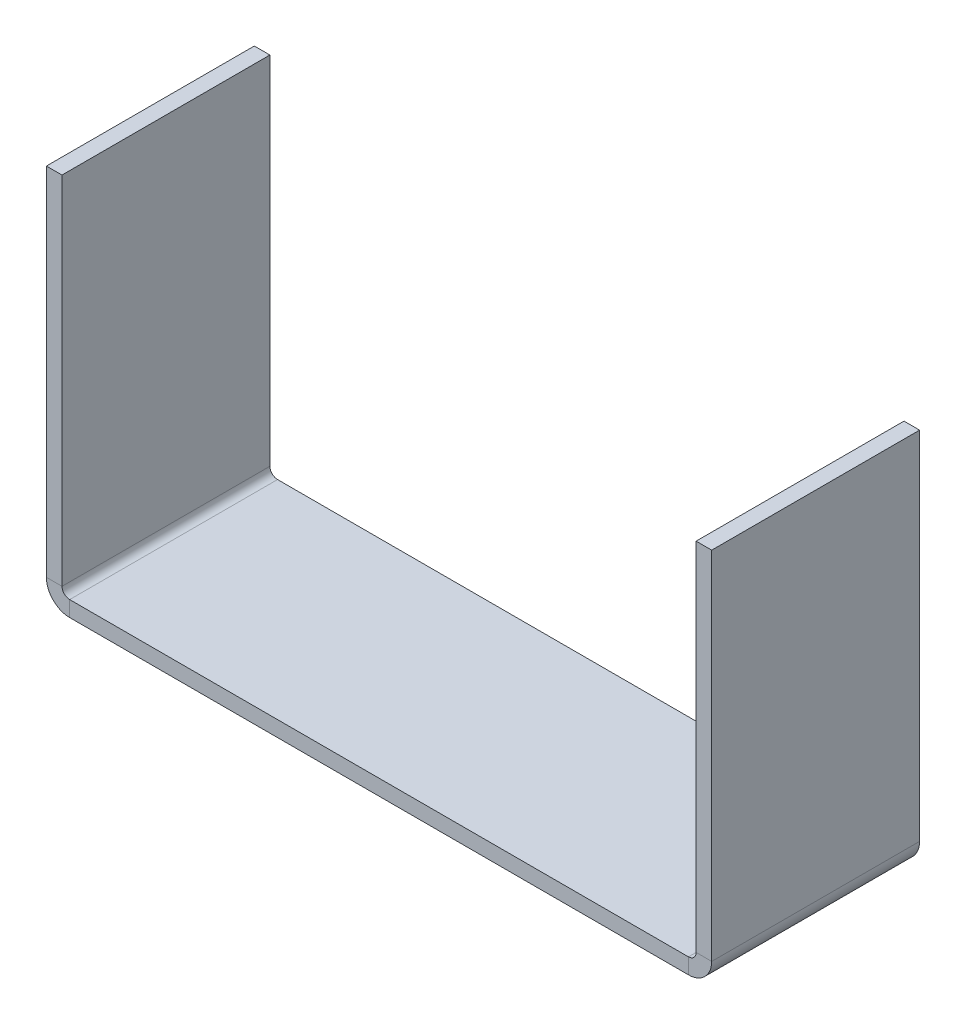
ISO-10303-21;
HEADER;
FILE_DESCRIPTION(('STEP AP214'),'2;1');
FILE_NAME('part.step','',(''),(''),'','','');
FILE_SCHEMA(('AUTOMOTIVE_DESIGN { 1 0 10303 214 1 1 1 1 }'));
ENDSEC;
DATA;
#1=APPLICATION_CONTEXT('core data for automotive mechanical design processes');
#2=APPLICATION_PROTOCOL_DEFINITION('international standard','automotive_design',2000,#1);
#3=PRODUCT_CONTEXT('',#1,'mechanical');
#4=PRODUCT('Part','Part','',(#3));
#5=PRODUCT_RELATED_PRODUCT_CATEGORY('part','',(#4));
#6=PRODUCT_DEFINITION_FORMATION('','',#4);
#7=PRODUCT_DEFINITION_CONTEXT('part definition',#1,'design');
#8=PRODUCT_DEFINITION('design','',#6,#7);
#9=PRODUCT_DEFINITION_SHAPE('','',#8);
#10=(LENGTH_UNIT() NAMED_UNIT(*) SI_UNIT(.MILLI.,.METRE.));
#11=(NAMED_UNIT(*) PLANE_ANGLE_UNIT() SI_UNIT($,.RADIAN.));
#12=(NAMED_UNIT(*) SI_UNIT($,.STERADIAN.) SOLID_ANGLE_UNIT());
#13=UNCERTAINTY_MEASURE_WITH_UNIT(LENGTH_MEASURE(1.E-05),#10,'distance_accuracy_value','');
#14=(GEOMETRIC_REPRESENTATION_CONTEXT(3) GLOBAL_UNCERTAINTY_ASSIGNED_CONTEXT((#13)) GLOBAL_UNIT_ASSIGNED_CONTEXT((#10,
#11,#12)) REPRESENTATION_CONTEXT('',''));
#15=CARTESIAN_POINT('',(0.,0.,0.));
#16=DIRECTION('',(0.,0.,1.));
#17=DIRECTION('',(1.,0.,0.));
#18=AXIS2_PLACEMENT_3D('',#15,#16,#17);
#19=CARTESIAN_POINT('',(0.,-1.5,0.));
#20=DIRECTION('',(0.,-1.,0.));
#21=DIRECTION('',(0.,0.,-1.));
#22=AXIS2_PLACEMENT_3D('',#19,#20,#21);
#23=PLANE('',#22);
#24=DIRECTION('',(-1.,0.,0.));
#25=VECTOR('',#24,1.);
#26=CARTESIAN_POINT('',(0.,-1.5,-20.));
#27=LINE('',#26,#25);
#28=CARTESIAN_POINT('',(61.7634,-1.49999999999999,-20.));
#29=VERTEX_POINT('',#28);
#30=CARTESIAN_POINT('',(2.2366,-1.5,-20.));
#31=VERTEX_POINT('',#30);
#32=EDGE_CURVE('E13',#29,#31,#27,.T.);
#33=ORIENTED_EDGE('',*,*,#32,.F.);
#34=DIRECTION('',(0.,0.,-1.));
#35=VECTOR('',#34,1.);
#36=CARTESIAN_POINT('',(61.7634,-1.49999999999999,-20.));
#37=LINE('',#36,#35);
#38=CARTESIAN_POINT('',(61.7634,-1.5,0.));
#39=VERTEX_POINT('',#38);
#40=EDGE_CURVE('E323',#29,#39,#37,.F.);
#41=ORIENTED_EDGE('',*,*,#40,.T.);
#42=DIRECTION('',(1.,0.,0.));
#43=VECTOR('',#42,1.);
#44=CARTESIAN_POINT('',(0.,-1.5,0.));
#45=LINE('',#44,#43);
#46=CARTESIAN_POINT('',(2.2366,-1.5,0.));
#47=VERTEX_POINT('',#46);
#48=EDGE_CURVE('E84',#47,#39,#45,.T.);
#49=ORIENTED_EDGE('',*,*,#48,.F.);
#50=DIRECTION('',(0.,0.,1.));
#51=VECTOR('',#50,1.);
#52=CARTESIAN_POINT('',(2.2366,-1.5,0.));
#53=LINE('',#52,#51);
#54=EDGE_CURVE('E98',#47,#31,#53,.F.);
#55=ORIENTED_EDGE('',*,*,#54,.T.);
#56=EDGE_LOOP('',(#33,#41,#49,#55));
#57=FACE_BOUND('',#56,.T.);
#58=ADVANCED_FACE('F75',(#57),#23,.T.);
#59=CARTESIAN_POINT('',(0.,0.,0.));
#60=DIRECTION('',(0.,-1.,0.));
#61=DIRECTION('',(0.,0.,-1.));
#62=AXIS2_PLACEMENT_3D('',#59,#60,#61);
#63=PLANE('',#62);
#64=DIRECTION('',(0.,0.,-1.));
#65=VECTOR('',#64,1.);
#66=CARTESIAN_POINT('',(61.7634,0.,-20.));
#67=LINE('',#66,#65);
#68=CARTESIAN_POINT('',(61.7634,0.,-20.));
#69=VERTEX_POINT('',#68);
#70=CARTESIAN_POINT('',(61.7634,0.,0.));
#71=VERTEX_POINT('',#70);
#72=EDGE_CURVE('E195',#69,#71,#67,.F.);
#73=ORIENTED_EDGE('',*,*,#72,.F.);
#74=DIRECTION('',(-1.,0.,0.));
#75=VECTOR('',#74,1.);
#76=CARTESIAN_POINT('',(0.,0.,-20.));
#77=LINE('',#76,#75);
#78=CARTESIAN_POINT('',(2.2366,0.,-20.));
#79=VERTEX_POINT('',#78);
#80=EDGE_CURVE('E79',#69,#79,#77,.T.);
#81=ORIENTED_EDGE('',*,*,#80,.T.);
#82=DIRECTION('',(0.,0.,1.));
#83=VECTOR('',#82,1.);
#84=CARTESIAN_POINT('',(2.2366,0.,0.));
#85=LINE('',#84,#83);
#86=CARTESIAN_POINT('',(2.2366,0.,0.));
#87=VERTEX_POINT('',#86);
#88=EDGE_CURVE('E142',#87,#79,#85,.F.);
#89=ORIENTED_EDGE('',*,*,#88,.F.);
#90=DIRECTION('',(1.,0.,0.));
#91=VECTOR('',#90,1.);
#92=CARTESIAN_POINT('',(0.,0.,0.));
#93=LINE('',#92,#91);
#94=EDGE_CURVE('E183',#87,#71,#93,.T.);
#95=ORIENTED_EDGE('',*,*,#94,.T.);
#96=EDGE_LOOP('',(#73,#81,#89,#95));
#97=FACE_BOUND('',#96,.T.);
#98=ADVANCED_FACE('F192',(#97),#63,.F.);
#99=CARTESIAN_POINT('',(0.,-1.5,-20.));
#100=DIRECTION('',(0.,0.,-1.));
#101=DIRECTION('',(-1.,0.,0.));
#102=AXIS2_PLACEMENT_3D('',#99,#100,#101);
#103=PLANE('',#102);
#104=ORIENTED_EDGE('',*,*,#80,.F.);
#105=DIRECTION('',(0.,-1.,0.));
#106=VECTOR('',#105,1.);
#107=CARTESIAN_POINT('',(61.7634,0.,-20.));
#108=LINE('',#107,#106);
#109=EDGE_CURVE('E329',#69,#29,#108,.T.);
#110=ORIENTED_EDGE('',*,*,#109,.T.);
#111=ORIENTED_EDGE('',*,*,#32,.T.);
#112=DIRECTION('',(0.,-1.,0.));
#113=VECTOR('',#112,1.);
#114=CARTESIAN_POINT('',(2.2366,0.,-20.));
#115=LINE('',#114,#113);
#116=EDGE_CURVE('E180',#79,#31,#115,.T.);
#117=ORIENTED_EDGE('',*,*,#116,.F.);
#118=EDGE_LOOP('',(#104,#110,#111,#117));
#119=FACE_BOUND('',#118,.T.);
#120=ADVANCED_FACE('F198',(#119),#103,.T.);
#121=CARTESIAN_POINT('',(0.,-1.5,0.));
#122=DIRECTION('',(0.,0.,1.));
#123=DIRECTION('',(1.,0.,0.));
#124=AXIS2_PLACEMENT_3D('',#121,#122,#123);
#125=PLANE('',#124);
#126=DIRECTION('',(0.,-1.,0.));
#127=VECTOR('',#126,1.);
#128=CARTESIAN_POINT('',(61.7634,0.,0.));
#129=LINE('',#128,#127);
#130=EDGE_CURVE('E171',#71,#39,#129,.T.);
#131=ORIENTED_EDGE('',*,*,#130,.F.);
#132=ORIENTED_EDGE('',*,*,#94,.F.);
#133=DIRECTION('',(0.,-1.,0.));
#134=VECTOR('',#133,1.);
#135=CARTESIAN_POINT('',(2.2366,0.,0.));
#136=LINE('',#135,#134);
#137=EDGE_CURVE('E141',#87,#47,#136,.T.);
#138=ORIENTED_EDGE('',*,*,#137,.T.);
#139=ORIENTED_EDGE('',*,*,#48,.T.);
#140=EDGE_LOOP('',(#131,#132,#138,#139));
#141=FACE_BOUND('',#140,.T.);
#142=ADVANCED_FACE('F77',(#141),#125,.T.);
#143=CARTESIAN_POINT('',(2.2366,0.7366,-20.));
#144=DIRECTION('',(0.,0.,-1.));
#145=DIRECTION('',(-1.,0.,0.));
#146=AXIS2_PLACEMENT_3D('',#143,#144,#145);
#147=PLANE('',#146);
#148=DIRECTION('',(1.,0.,0.));
#149=VECTOR('',#148,1.);
#150=CARTESIAN_POINT('',(0.,0.736599999999992,-20.));
#151=LINE('',#150,#149);
#152=CARTESIAN_POINT('',(1.5,0.736599999999997,-20.));
#153=VERTEX_POINT('',#152);
#154=CARTESIAN_POINT('',(0.,0.736599999999992,-20.));
#155=VERTEX_POINT('',#154);
#156=EDGE_CURVE('E132',#153,#155,#151,.F.);
#157=ORIENTED_EDGE('',*,*,#156,.F.);
#158=CARTESIAN_POINT('',(2.2366,0.7366,-20.));
#159=DIRECTION('',(0.,0.,1.));
#160=DIRECTION('',(1.,0.,0.));
#161=AXIS2_PLACEMENT_3D('',#158,#159,#160);
#162=CIRCLE('',#161,0.7366);
#163=EDGE_CURVE('E126',#79,#153,#162,.F.);
#164=ORIENTED_EDGE('',*,*,#163,.F.);
#165=ORIENTED_EDGE('',*,*,#116,.T.);
#166=CARTESIAN_POINT('',(2.2366,0.7366,-20.));
#167=DIRECTION('',(0.,0.,1.));
#168=DIRECTION('',(1.,0.,0.));
#169=AXIS2_PLACEMENT_3D('',#166,#167,#168);
#170=CIRCLE('',#169,2.2366);
#171=EDGE_CURVE('E173',#31,#155,#170,.F.);
#172=ORIENTED_EDGE('',*,*,#171,.T.);
#173=EDGE_LOOP('',(#157,#164,#165,#172));
#174=FACE_BOUND('',#173,.T.);
#175=ADVANCED_FACE('F197',(#174),#147,.T.);
#176=CARTESIAN_POINT('',(2.2366,0.7366,0.));
#177=DIRECTION('',(0.,0.,-1.));
#178=DIRECTION('',(-1.,0.,0.));
#179=AXIS2_PLACEMENT_3D('',#176,#177,#178);
#180=PLANE('',#179);
#181=CARTESIAN_POINT('',(2.2366,0.7366,0.));
#182=DIRECTION('',(0.,0.,1.));
#183=DIRECTION('',(1.,0.,0.));
#184=AXIS2_PLACEMENT_3D('',#181,#182,#183);
#185=CIRCLE('',#184,0.7366);
#186=CARTESIAN_POINT('',(1.5,0.736599999999997,0.));
#187=VERTEX_POINT('',#186);
#188=EDGE_CURVE('E123',#187,#87,#185,.T.);
#189=ORIENTED_EDGE('',*,*,#188,.F.);
#190=DIRECTION('',(1.,0.,0.));
#191=VECTOR('',#190,1.);
#192=CARTESIAN_POINT('',(1.5,0.736599999999997,0.));
#193=LINE('',#192,#191);
#194=CARTESIAN_POINT('',(0.,0.736599999999992,0.));
#195=VERTEX_POINT('',#194);
#196=EDGE_CURVE('E131',#187,#195,#193,.F.);
#197=ORIENTED_EDGE('',*,*,#196,.T.);
#198=CARTESIAN_POINT('',(2.2366,0.7366,0.));
#199=DIRECTION('',(0.,0.,1.));
#200=DIRECTION('',(1.,0.,0.));
#201=AXIS2_PLACEMENT_3D('',#198,#199,#200);
#202=CIRCLE('',#201,2.2366);
#203=EDGE_CURVE('E174',#195,#47,#202,.T.);
#204=ORIENTED_EDGE('',*,*,#203,.T.);
#205=ORIENTED_EDGE('',*,*,#137,.F.);
#206=EDGE_LOOP('',(#189,#197,#204,#205));
#207=FACE_BOUND('',#206,.T.);
#208=ADVANCED_FACE('F137',(#207),#180,.F.);
#209=CARTESIAN_POINT('',(2.2366,0.7366,0.));
#210=DIRECTION('',(0.,0.,1.));
#211=DIRECTION('',(-1.,0.,0.));
#212=AXIS2_PLACEMENT_3D('',#209,#210,#211);
#213=CYLINDRICAL_SURFACE('',#212,2.2366);
#214=ORIENTED_EDGE('',*,*,#54,.F.);
#215=ORIENTED_EDGE('',*,*,#203,.F.);
#216=DIRECTION('',(0.,0.,1.));
#217=VECTOR('',#216,1.);
#218=CARTESIAN_POINT('',(0.,0.736599999999992,-20.));
#219=LINE('',#218,#217);
#220=EDGE_CURVE('E155',#195,#155,#219,.F.);
#221=ORIENTED_EDGE('',*,*,#220,.T.);
#222=ORIENTED_EDGE('',*,*,#171,.F.);
#223=EDGE_LOOP('',(#214,#215,#221,#222));
#224=FACE_BOUND('',#223,.T.);
#225=ADVANCED_FACE('F214',(#224),#213,.T.);
#226=CARTESIAN_POINT('',(2.2366,0.7366,0.));
#227=DIRECTION('',(0.,0.,1.));
#228=DIRECTION('',(-1.,0.,0.));
#229=AXIS2_PLACEMENT_3D('',#226,#227,#228);
#230=CYLINDRICAL_SURFACE('',#229,0.7366);
#231=ORIENTED_EDGE('',*,*,#88,.T.);
#232=ORIENTED_EDGE('',*,*,#163,.T.);
#233=DIRECTION('',(0.,0.,1.));
#234=VECTOR('',#233,1.);
#235=CARTESIAN_POINT('',(1.5,0.736599999999997,-20.));
#236=LINE('',#235,#234);
#237=EDGE_CURVE('E119',#153,#187,#236,.T.);
#238=ORIENTED_EDGE('',*,*,#237,.T.);
#239=ORIENTED_EDGE('',*,*,#188,.T.);
#240=EDGE_LOOP('',(#231,#232,#238,#239));
#241=FACE_BOUND('',#240,.T.);
#242=ADVANCED_FACE('F122',(#241),#230,.F.);
#243=CARTESIAN_POINT('',(0.,0.,-20.));
#244=DIRECTION('',(0.,0.,1.));
#245=DIRECTION('',(1.,0.,0.));
#246=AXIS2_PLACEMENT_3D('',#243,#244,#245);
#247=PLANE('',#246);
#248=ORIENTED_EDGE('',*,*,#156,.T.);
#249=DIRECTION('',(0.,-1.,0.));
#250=VECTOR('',#249,1.);
#251=CARTESIAN_POINT('',(0.,0.,-20.));
#252=LINE('',#251,#250);
#253=CARTESIAN_POINT('',(-1.2220184685951E-13,35.,-20.));
#254=VERTEX_POINT('',#253);
#255=EDGE_CURVE('E163',#254,#155,#252,.T.);
#256=ORIENTED_EDGE('',*,*,#255,.F.);
#257=DIRECTION('',(1.,0.,0.));
#258=VECTOR('',#257,1.);
#259=CARTESIAN_POINT('',(-1.2220184685951E-13,35.,-20.));
#260=LINE('',#259,#258);
#261=CARTESIAN_POINT('',(1.49999999999988,35.,-20.));
#262=VERTEX_POINT('',#261);
#263=EDGE_CURVE('E343',#254,#262,#260,.T.);
#264=ORIENTED_EDGE('',*,*,#263,.T.);
#265=DIRECTION('',(0.,1.,0.));
#266=VECTOR('',#265,1.);
#267=CARTESIAN_POINT('',(1.5,0.,-20.));
#268=LINE('',#267,#266);
#269=EDGE_CURVE('E161',#262,#153,#268,.F.);
#270=ORIENTED_EDGE('',*,*,#269,.T.);
#271=EDGE_LOOP('',(#248,#256,#264,#270));
#272=FACE_BOUND('',#271,.T.);
#273=ADVANCED_FACE('F219',(#272),#247,.F.);
#274=CARTESIAN_POINT('',(-1.22298005056365E-13,35.,0.));
#275=DIRECTION('',(0.,0.,-1.));
#276=DIRECTION('',(-1.,0.,0.));
#277=AXIS2_PLACEMENT_3D('',#274,#275,#276);
#278=PLANE('',#277);
#279=ORIENTED_EDGE('',*,*,#196,.F.);
#280=DIRECTION('',(0.,-1.,0.));
#281=VECTOR('',#280,1.);
#282=CARTESIAN_POINT('',(1.49999999999988,35.,0.));
#283=LINE('',#282,#281);
#284=CARTESIAN_POINT('',(1.49999999999988,35.,0.));
#285=VERTEX_POINT('',#284);
#286=EDGE_CURVE('E151',#187,#285,#283,.F.);
#287=ORIENTED_EDGE('',*,*,#286,.T.);
#288=DIRECTION('',(1.,0.,0.));
#289=VECTOR('',#288,1.);
#290=CARTESIAN_POINT('',(-1.22298005056365E-13,35.,0.));
#291=LINE('',#290,#289);
#292=CARTESIAN_POINT('',(-1.2220184685951E-13,35.,0.));
#293=VERTEX_POINT('',#292);
#294=EDGE_CURVE('E143',#293,#285,#291,.T.);
#295=ORIENTED_EDGE('',*,*,#294,.F.);
#296=DIRECTION('',(0.,1.,0.));
#297=VECTOR('',#296,1.);
#298=CARTESIAN_POINT('',(0.,0.,0.));
#299=LINE('',#298,#297);
#300=EDGE_CURVE('E154',#195,#293,#299,.T.);
#301=ORIENTED_EDGE('',*,*,#300,.F.);
#302=EDGE_LOOP('',(#279,#287,#295,#301));
#303=FACE_BOUND('',#302,.T.);
#304=ADVANCED_FACE('F148',(#303),#278,.F.);
#305=CARTESIAN_POINT('',(0.,0.,0.));
#306=DIRECTION('',(1.,0.,0.));
#307=DIRECTION('',(0.,1.,0.));
#308=AXIS2_PLACEMENT_3D('',#305,#306,#307);
#309=PLANE('',#308);
#310=ORIENTED_EDGE('',*,*,#220,.F.);
#311=ORIENTED_EDGE('',*,*,#300,.T.);
#312=DIRECTION('',(0.,0.,-1.));
#313=VECTOR('',#312,1.);
#314=CARTESIAN_POINT('',(-1.2220184685951E-13,35.,0.));
#315=LINE('',#314,#313);
#316=EDGE_CURVE('E346',#293,#254,#315,.T.);
#317=ORIENTED_EDGE('',*,*,#316,.T.);
#318=ORIENTED_EDGE('',*,*,#255,.T.);
#319=EDGE_LOOP('',(#310,#311,#317,#318));
#320=FACE_BOUND('',#319,.T.);
#321=ADVANCED_FACE('F227',(#320),#309,.F.);
#322=CARTESIAN_POINT('',(1.5,0.,0.));
#323=DIRECTION('',(1.,0.,0.));
#324=DIRECTION('',(0.,1.,0.));
#325=AXIS2_PLACEMENT_3D('',#322,#323,#324);
#326=PLANE('',#325);
#327=ORIENTED_EDGE('',*,*,#286,.F.);
#328=ORIENTED_EDGE('',*,*,#237,.F.);
#329=ORIENTED_EDGE('',*,*,#269,.F.);
#330=DIRECTION('',(0.,0.,1.));
#331=VECTOR('',#330,1.);
#332=CARTESIAN_POINT('',(1.49999999999988,35.,-20.));
#333=LINE('',#332,#331);
#334=EDGE_CURVE('E160',#285,#262,#333,.F.);
#335=ORIENTED_EDGE('',*,*,#334,.F.);
#336=EDGE_LOOP('',(#327,#328,#329,#335));
#337=FACE_BOUND('',#336,.T.);
#338=ADVANCED_FACE('F158',(#337),#326,.T.);
#339=CARTESIAN_POINT('',(-1.22298005056365E-13,35.,-20.));
#340=DIRECTION('',(0.,-1.,0.));
#341=DIRECTION('',(1.,0.,0.));
#342=AXIS2_PLACEMENT_3D('',#339,#340,#341);
#343=PLANE('',#342);
#344=ORIENTED_EDGE('',*,*,#334,.T.);
#345=ORIENTED_EDGE('',*,*,#263,.F.);
#346=ORIENTED_EDGE('',*,*,#316,.F.);
#347=ORIENTED_EDGE('',*,*,#294,.T.);
#348=EDGE_LOOP('',(#344,#345,#346,#347));
#349=FACE_BOUND('',#348,.T.);
#350=ADVANCED_FACE('F228',(#349),#343,.F.);
#351=CARTESIAN_POINT('',(61.7634,0.736600000000006,0.));
#352=DIRECTION('',(0.,0.,1.));
#353=DIRECTION('',(1.,0.,0.));
#354=AXIS2_PLACEMENT_3D('',#351,#352,#353);
#355=PLANE('',#354);
#356=DIRECTION('',(-1.,0.,0.));
#357=VECTOR('',#356,1.);
#358=CARTESIAN_POINT('',(64.,0.736599999999999,0.));
#359=LINE('',#358,#357);
#360=CARTESIAN_POINT('',(62.5,0.736600000000004,0.));
#361=VERTEX_POINT('',#360);
#362=CARTESIAN_POINT('',(64.,0.736599999999998,0.));
#363=VERTEX_POINT('',#362);
#364=EDGE_CURVE('E320',#361,#363,#359,.F.);
#365=ORIENTED_EDGE('',*,*,#364,.F.);
#366=CARTESIAN_POINT('',(61.7634,0.736600000000006,0.));
#367=DIRECTION('',(0.,0.,-1.));
#368=DIRECTION('',(-1.,0.,0.));
#369=AXIS2_PLACEMENT_3D('',#366,#367,#368);
#370=CIRCLE('',#369,0.736599999999997);
#371=EDGE_CURVE('E332',#71,#361,#370,.F.);
#372=ORIENTED_EDGE('',*,*,#371,.F.);
#373=ORIENTED_EDGE('',*,*,#130,.T.);
#374=CARTESIAN_POINT('',(61.7634,0.736600000000006,0.));
#375=DIRECTION('',(0.,0.,-1.));
#376=DIRECTION('',(-1.,0.,0.));
#377=AXIS2_PLACEMENT_3D('',#374,#375,#376);
#378=CIRCLE('',#377,2.2366);
#379=EDGE_CURVE('E326',#39,#363,#378,.F.);
#380=ORIENTED_EDGE('',*,*,#379,.T.);
#381=EDGE_LOOP('',(#365,#372,#373,#380));
#382=FACE_BOUND('',#381,.T.);
#383=ADVANCED_FACE('F231',(#382),#355,.T.);
#384=CARTESIAN_POINT('',(61.7634,0.736600000000006,-20.));
#385=DIRECTION('',(0.,0.,1.));
#386=DIRECTION('',(1.,0.,0.));
#387=AXIS2_PLACEMENT_3D('',#384,#385,#386);
#388=PLANE('',#387);
#389=CARTESIAN_POINT('',(61.7634,0.736600000000006,-20.));
#390=DIRECTION('',(0.,0.,-1.));
#391=DIRECTION('',(-1.,0.,0.));
#392=AXIS2_PLACEMENT_3D('',#389,#390,#391);
#393=CIRCLE('',#392,0.736599999999997);
#394=CARTESIAN_POINT('',(62.5,0.736600000000004,-20.));
#395=VERTEX_POINT('',#394);
#396=EDGE_CURVE('E336',#395,#69,#393,.T.);
#397=ORIENTED_EDGE('',*,*,#396,.F.);
#398=DIRECTION('',(-1.,0.,0.));
#399=VECTOR('',#398,1.);
#400=CARTESIAN_POINT('',(62.5,0.736600000000004,-20.));
#401=LINE('',#400,#399);
#402=CARTESIAN_POINT('',(64.,0.736599999999999,-20.));
#403=VERTEX_POINT('',#402);
#404=EDGE_CURVE('E294',#395,#403,#401,.F.);
#405=ORIENTED_EDGE('',*,*,#404,.T.);
#406=CARTESIAN_POINT('',(61.7634,0.736600000000006,-20.));
#407=DIRECTION('',(0.,0.,-1.));
#408=DIRECTION('',(-1.,0.,0.));
#409=AXIS2_PLACEMENT_3D('',#406,#407,#408);
#410=CIRCLE('',#409,2.2366);
#411=EDGE_CURVE('E327',#403,#29,#410,.T.);
#412=ORIENTED_EDGE('',*,*,#411,.T.);
#413=ORIENTED_EDGE('',*,*,#109,.F.);
#414=EDGE_LOOP('',(#397,#405,#412,#413));
#415=FACE_BOUND('',#414,.T.);
#416=ADVANCED_FACE('F238',(#415),#388,.F.);
#417=CARTESIAN_POINT('',(61.7634,0.736600000000006,-20.));
#418=DIRECTION('',(0.,0.,-1.));
#419=DIRECTION('',(1.,0.,0.));
#420=AXIS2_PLACEMENT_3D('',#417,#418,#419);
#421=CYLINDRICAL_SURFACE('',#420,2.2366);
#422=ORIENTED_EDGE('',*,*,#40,.F.);
#423=ORIENTED_EDGE('',*,*,#411,.F.);
#424=DIRECTION('',(0.,0.,-1.));
#425=VECTOR('',#424,1.);
#426=CARTESIAN_POINT('',(64.,0.736599999999999,0.));
#427=LINE('',#426,#425);
#428=EDGE_CURVE('E279',#403,#363,#427,.F.);
#429=ORIENTED_EDGE('',*,*,#428,.T.);
#430=ORIENTED_EDGE('',*,*,#379,.F.);
#431=EDGE_LOOP('',(#422,#423,#429,#430));
#432=FACE_BOUND('',#431,.T.);
#433=ADVANCED_FACE('F241',(#432),#421,.T.);
#434=CARTESIAN_POINT('',(61.7634,0.736600000000006,-20.));
#435=DIRECTION('',(0.,0.,-1.));
#436=DIRECTION('',(1.,0.,0.));
#437=AXIS2_PLACEMENT_3D('',#434,#435,#436);
#438=CYLINDRICAL_SURFACE('',#437,0.736599999999997);
#439=ORIENTED_EDGE('',*,*,#72,.T.);
#440=ORIENTED_EDGE('',*,*,#371,.T.);
#441=DIRECTION('',(0.,0.,-1.));
#442=VECTOR('',#441,1.);
#443=CARTESIAN_POINT('',(62.5,0.736600000000004,0.));
#444=LINE('',#443,#442);
#445=EDGE_CURVE('E317',#361,#395,#444,.T.);
#446=ORIENTED_EDGE('',*,*,#445,.T.);
#447=ORIENTED_EDGE('',*,*,#396,.T.);
#448=EDGE_LOOP('',(#439,#440,#446,#447));
#449=FACE_BOUND('',#448,.T.);
#450=ADVANCED_FACE('F246',(#449),#438,.F.);
#451=CARTESIAN_POINT('',(64.0000000000001,35.,-20.));
#452=DIRECTION('',(0.,0.,1.));
#453=DIRECTION('',(1.,0.,0.));
#454=AXIS2_PLACEMENT_3D('',#451,#452,#453);
#455=PLANE('',#454);
#456=ORIENTED_EDGE('',*,*,#404,.F.);
#457=DIRECTION('',(0.,-1.,0.));
#458=VECTOR('',#457,1.);
#459=CARTESIAN_POINT('',(62.5000000000001,35.,-20.));
#460=LINE('',#459,#458);
#461=CARTESIAN_POINT('',(62.5000000000001,35.,-20.));
#462=VERTEX_POINT('',#461);
#463=EDGE_CURVE('E293',#395,#462,#460,.F.);
#464=ORIENTED_EDGE('',*,*,#463,.T.);
#465=DIRECTION('',(-1.,0.,0.));
#466=VECTOR('',#465,1.);
#467=CARTESIAN_POINT('',(64.0000000000001,35.,-20.));
#468=LINE('',#467,#466);
#469=CARTESIAN_POINT('',(64.0000000000001,35.,-20.));
#470=VERTEX_POINT('',#469);
#471=EDGE_CURVE('E302',#470,#462,#468,.T.);
#472=ORIENTED_EDGE('',*,*,#471,.F.);
#473=DIRECTION('',(0.,1.,0.));
#474=VECTOR('',#473,1.);
#475=CARTESIAN_POINT('',(64.,-2.33625958502583E-13,-20.));
#476=LINE('',#475,#474);
#477=EDGE_CURVE('E283',#403,#470,#476,.T.);
#478=ORIENTED_EDGE('',*,*,#477,.F.);
#479=EDGE_LOOP('',(#456,#464,#472,#478));
#480=FACE_BOUND('',#479,.T.);
#481=ADVANCED_FACE('F249',(#480),#455,.F.);
#482=CARTESIAN_POINT('',(64.,0.,0.));
#483=DIRECTION('',(0.,0.,-1.));
#484=DIRECTION('',(-1.,0.,0.));
#485=AXIS2_PLACEMENT_3D('',#482,#483,#484);
#486=PLANE('',#485);
#487=ORIENTED_EDGE('',*,*,#364,.T.);
#488=DIRECTION('',(0.,-1.,0.));
#489=VECTOR('',#488,1.);
#490=CARTESIAN_POINT('',(64.,-2.33625958502583E-13,0.));
#491=LINE('',#490,#489);
#492=CARTESIAN_POINT('',(64.0000000000001,35.,0.));
#493=VERTEX_POINT('',#492);
#494=EDGE_CURVE('E287',#493,#363,#491,.T.);
#495=ORIENTED_EDGE('',*,*,#494,.F.);
#496=DIRECTION('',(-1.,0.,0.));
#497=VECTOR('',#496,1.);
#498=CARTESIAN_POINT('',(64.0000000000001,35.,0.));
#499=LINE('',#498,#497);
#500=CARTESIAN_POINT('',(62.5000000000001,35.,0.));
#501=VERTEX_POINT('',#500);
#502=EDGE_CURVE('E382',#493,#501,#499,.T.);
#503=ORIENTED_EDGE('',*,*,#502,.T.);
#504=DIRECTION('',(0.,1.,0.));
#505=VECTOR('',#504,1.);
#506=CARTESIAN_POINT('',(62.5,0.,0.));
#507=LINE('',#506,#505);
#508=EDGE_CURVE('E305',#501,#361,#507,.F.);
#509=ORIENTED_EDGE('',*,*,#508,.T.);
#510=EDGE_LOOP('',(#487,#495,#503,#509));
#511=FACE_BOUND('',#510,.T.);
#512=ADVANCED_FACE('F256',(#511),#486,.F.);
#513=CARTESIAN_POINT('',(64.,-2.33625958502583E-13,0.));
#514=DIRECTION('',(-1.,0.,0.));
#515=DIRECTION('',(0.,-1.,0.));
#516=AXIS2_PLACEMENT_3D('',#513,#514,#515);
#517=PLANE('',#516);
#518=ORIENTED_EDGE('',*,*,#428,.F.);
#519=ORIENTED_EDGE('',*,*,#477,.T.);
#520=DIRECTION('',(0.,0.,1.));
#521=VECTOR('',#520,1.);
#522=CARTESIAN_POINT('',(64.0000000000001,35.,0.));
#523=LINE('',#522,#521);
#524=EDGE_CURVE('E304',#470,#493,#523,.T.);
#525=ORIENTED_EDGE('',*,*,#524,.T.);
#526=ORIENTED_EDGE('',*,*,#494,.T.);
#527=EDGE_LOOP('',(#518,#519,#525,#526));
#528=FACE_BOUND('',#527,.T.);
#529=ADVANCED_FACE('F265',(#528),#517,.F.);
#530=CARTESIAN_POINT('',(62.5,-2.28388736494318E-13,0.));
#531=DIRECTION('',(-1.,0.,0.));
#532=DIRECTION('',(0.,-1.,0.));
#533=AXIS2_PLACEMENT_3D('',#530,#531,#532);
#534=PLANE('',#533);
#535=ORIENTED_EDGE('',*,*,#463,.F.);
#536=ORIENTED_EDGE('',*,*,#445,.F.);
#537=ORIENTED_EDGE('',*,*,#508,.F.);
#538=DIRECTION('',(0.,0.,-1.));
#539=VECTOR('',#538,1.);
#540=CARTESIAN_POINT('',(62.5000000000001,35.,0.));
#541=LINE('',#540,#539);
#542=EDGE_CURVE('E309',#462,#501,#541,.F.);
#543=ORIENTED_EDGE('',*,*,#542,.F.);
#544=EDGE_LOOP('',(#535,#536,#537,#543));
#545=FACE_BOUND('',#544,.T.);
#546=ADVANCED_FACE('F261',(#545),#534,.T.);
#547=CARTESIAN_POINT('',(64.0000000000001,35.,0.));
#548=DIRECTION('',(0.,-1.,0.));
#549=DIRECTION('',(1.,0.,0.));
#550=AXIS2_PLACEMENT_3D('',#547,#548,#549);
#551=PLANE('',#550);
#552=ORIENTED_EDGE('',*,*,#542,.T.);
#553=ORIENTED_EDGE('',*,*,#502,.F.);
#554=ORIENTED_EDGE('',*,*,#524,.F.);
#555=ORIENTED_EDGE('',*,*,#471,.T.);
#556=EDGE_LOOP('',(#552,#553,#554,#555));
#557=FACE_BOUND('',#556,.T.);
#558=ADVANCED_FACE('F258',(#557),#551,.F.);
#559=CLOSED_SHELL('',(#58,#98,#120,#142,#175,#208,#225,#242,#273,#304,#321,#338,#350,#383,#416,
#433,#450,#481,#512,#529,#546,#558));
#560=MANIFOLD_SOLID_BREP('B2',#559);
#561=ADVANCED_BREP_SHAPE_REPRESENTATION('',(#18,#560),#14);
#562=SHAPE_DEFINITION_REPRESENTATION(#9,#561);
ENDSEC;
END-ISO-10303-21;
